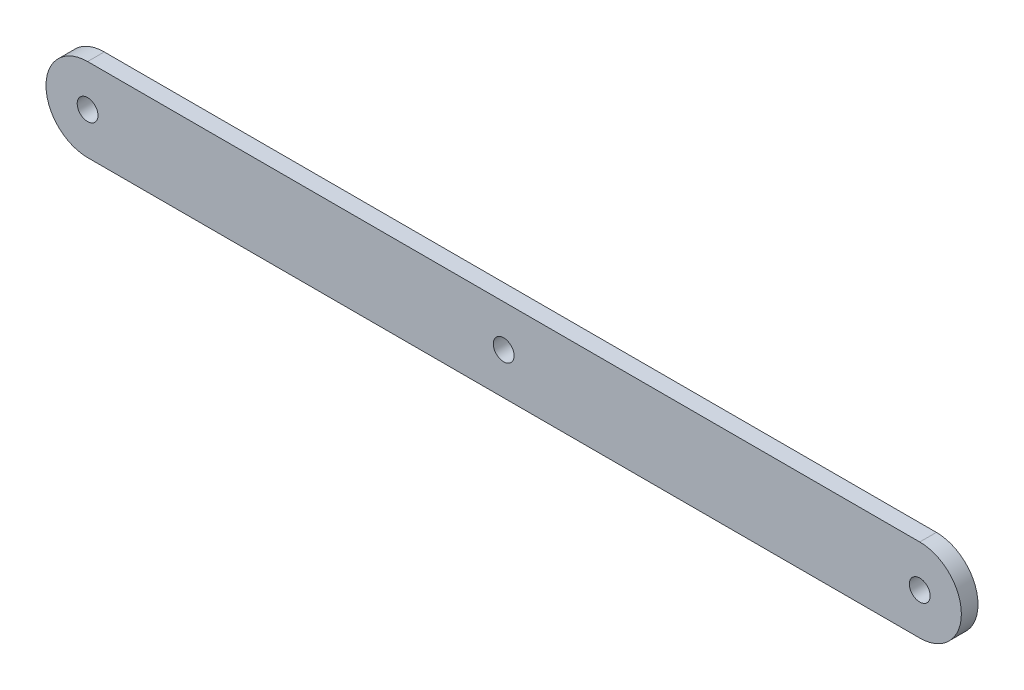
ISO-10303-21;
HEADER;
FILE_DESCRIPTION(('STEP AP214'),'2;1');
FILE_NAME('part.step','',(''),(''),'','','');
FILE_SCHEMA(('AUTOMOTIVE_DESIGN { 1 0 10303 214 1 1 1 1 }'));
ENDSEC;
DATA;
#1=APPLICATION_CONTEXT('core data for automotive mechanical design processes');
#2=APPLICATION_PROTOCOL_DEFINITION('international standard','automotive_design',2000,#1);
#3=PRODUCT_CONTEXT('',#1,'mechanical');
#4=PRODUCT('Part','Part','',(#3));
#5=PRODUCT_RELATED_PRODUCT_CATEGORY('part','',(#4));
#6=PRODUCT_DEFINITION_FORMATION('','',#4);
#7=PRODUCT_DEFINITION_CONTEXT('part definition',#1,'design');
#8=PRODUCT_DEFINITION('design','',#6,#7);
#9=PRODUCT_DEFINITION_SHAPE('','',#8);
#10=(LENGTH_UNIT() NAMED_UNIT(*) SI_UNIT(.MILLI.,.METRE.));
#11=(NAMED_UNIT(*) PLANE_ANGLE_UNIT() SI_UNIT($,.RADIAN.));
#12=(NAMED_UNIT(*) SI_UNIT($,.STERADIAN.) SOLID_ANGLE_UNIT());
#13=UNCERTAINTY_MEASURE_WITH_UNIT(LENGTH_MEASURE(1.E-05),#10,'distance_accuracy_value','');
#14=(GEOMETRIC_REPRESENTATION_CONTEXT(3) GLOBAL_UNCERTAINTY_ASSIGNED_CONTEXT((#13)) GLOBAL_UNIT_ASSIGNED_CONTEXT((#10,
#11,#12)) REPRESENTATION_CONTEXT('',''));
#15=CARTESIAN_POINT('',(0.,0.,0.));
#16=DIRECTION('',(0.,0.,1.));
#17=DIRECTION('',(1.,0.,0.));
#18=AXIS2_PLACEMENT_3D('',#15,#16,#17);
#19=CARTESIAN_POINT('',(-500.,0.,20.));
#20=DIRECTION('',(0.,0.,1.));
#21=DIRECTION('',(1.,0.,0.));
#22=AXIS2_PLACEMENT_3D('',#19,#20,#21);
#23=PLANE('',#22);
#24=CARTESIAN_POINT('',(500.,0.,20.));
#25=DIRECTION('',(0.,0.,1.));
#26=DIRECTION('',(1.,0.,0.));
#27=AXIS2_PLACEMENT_3D('',#24,#25,#26);
#28=CIRCLE('',#27,12.5);
#29=CARTESIAN_POINT('',(512.5,0.,20.));
#30=VERTEX_POINT('',#29);
#31=EDGE_CURVE('E116',#30,#30,#28,.T.);
#32=ORIENTED_EDGE('',*,*,#31,.F.);
#33=EDGE_LOOP('',(#32));
#34=FACE_BOUND('',#33,.T.);
#35=CARTESIAN_POINT('',(-500.,0.,20.));
#36=DIRECTION('',(0.,0.,1.));
#37=DIRECTION('',(1.,0.,0.));
#38=AXIS2_PLACEMENT_3D('',#35,#36,#37);
#39=CIRCLE('',#38,49.9999999999997);
#40=CARTESIAN_POINT('',(-500.,49.9999999999997,20.));
#41=VERTEX_POINT('',#40);
#42=CARTESIAN_POINT('',(-500.,-49.9999999999996,20.));
#43=VERTEX_POINT('',#42);
#44=EDGE_CURVE('E86',#41,#43,#39,.T.);
#45=ORIENTED_EDGE('',*,*,#44,.T.);
#46=DIRECTION('',(1.,0.,0.));
#47=VECTOR('',#46,1.);
#48=CARTESIAN_POINT('',(-500.,-49.9999999999996,20.));
#49=LINE('',#48,#47);
#50=CARTESIAN_POINT('',(500.,-50.,20.));
#51=VERTEX_POINT('',#50);
#52=EDGE_CURVE('E81',#43,#51,#49,.T.);
#53=ORIENTED_EDGE('',*,*,#52,.T.);
#54=CARTESIAN_POINT('',(500.,0.,20.));
#55=DIRECTION('',(0.,0.,1.));
#56=DIRECTION('',(1.,0.,0.));
#57=AXIS2_PLACEMENT_3D('',#54,#55,#56);
#58=CIRCLE('',#57,50.);
#59=CARTESIAN_POINT('',(500.,50.0000000000003,20.));
#60=VERTEX_POINT('',#59);
#61=EDGE_CURVE('E84',#51,#60,#58,.T.);
#62=ORIENTED_EDGE('',*,*,#61,.T.);
#63=DIRECTION('',(-1.,0.,0.));
#64=VECTOR('',#63,1.);
#65=CARTESIAN_POINT('',(-500.,49.9999999999997,20.));
#66=LINE('',#65,#64);
#67=EDGE_CURVE('E51',#60,#41,#66,.T.);
#68=ORIENTED_EDGE('',*,*,#67,.T.);
#69=EDGE_LOOP('',(#45,#53,#62,#68));
#70=FACE_BOUND('',#69,.T.);
#71=CARTESIAN_POINT('',(-500.,0.,20.));
#72=DIRECTION('',(0.,0.,1.));
#73=DIRECTION('',(1.,0.,0.));
#74=AXIS2_PLACEMENT_3D('',#71,#72,#73);
#75=CIRCLE('',#74,12.5);
#76=CARTESIAN_POINT('',(-487.5,0.,20.));
#77=VERTEX_POINT('',#76);
#78=EDGE_CURVE('E101',#77,#77,#75,.T.);
#79=ORIENTED_EDGE('',*,*,#78,.F.);
#80=EDGE_LOOP('',(#79));
#81=FACE_BOUND('',#80,.T.);
#82=CARTESIAN_POINT('',(0.,0.,20.));
#83=DIRECTION('',(0.,0.,1.));
#84=DIRECTION('',(1.,0.,0.));
#85=AXIS2_PLACEMENT_3D('',#82,#83,#84);
#86=CIRCLE('',#85,12.5);
#87=CARTESIAN_POINT('',(12.5,0.,20.));
#88=VERTEX_POINT('',#87);
#89=EDGE_CURVE('E122',#88,#88,#86,.T.);
#90=ORIENTED_EDGE('',*,*,#89,.F.);
#91=EDGE_LOOP('',(#90));
#92=FACE_BOUND('',#91,.T.);
#93=ADVANCED_FACE('F34',(#34,#70,#81,#92),#23,.T.);
#94=CARTESIAN_POINT('',(-500.,0.,0.));
#95=DIRECTION('',(0.,0.,1.));
#96=DIRECTION('',(1.,0.,0.));
#97=AXIS2_PLACEMENT_3D('',#94,#95,#96);
#98=PLANE('',#97);
#99=CARTESIAN_POINT('',(-500.,0.,0.));
#100=DIRECTION('',(0.,0.,1.));
#101=DIRECTION('',(1.,0.,0.));
#102=AXIS2_PLACEMENT_3D('',#99,#100,#101);
#103=CIRCLE('',#102,49.9999999999997);
#104=CARTESIAN_POINT('',(-500.,49.9999999999997,0.));
#105=VERTEX_POINT('',#104);
#106=CARTESIAN_POINT('',(-500.,-49.9999999999996,0.));
#107=VERTEX_POINT('',#106);
#108=EDGE_CURVE('E98',#105,#107,#103,.T.);
#109=ORIENTED_EDGE('',*,*,#108,.F.);
#110=DIRECTION('',(-1.,0.,0.));
#111=VECTOR('',#110,1.);
#112=CARTESIAN_POINT('',(-500.,49.9999999999997,0.));
#113=LINE('',#112,#111);
#114=CARTESIAN_POINT('',(500.,50.0000000000003,0.));
#115=VERTEX_POINT('',#114);
#116=EDGE_CURVE('E74',#115,#105,#113,.T.);
#117=ORIENTED_EDGE('',*,*,#116,.F.);
#118=CARTESIAN_POINT('',(500.,0.,0.));
#119=DIRECTION('',(0.,0.,1.));
#120=DIRECTION('',(1.,0.,0.));
#121=AXIS2_PLACEMENT_3D('',#118,#119,#120);
#122=CIRCLE('',#121,50.);
#123=CARTESIAN_POINT('',(500.,-50.,0.));
#124=VERTEX_POINT('',#123);
#125=EDGE_CURVE('E68',#124,#115,#122,.T.);
#126=ORIENTED_EDGE('',*,*,#125,.F.);
#127=DIRECTION('',(1.,0.,0.));
#128=VECTOR('',#127,1.);
#129=CARTESIAN_POINT('',(-500.,-49.9999999999996,0.));
#130=LINE('',#129,#128);
#131=EDGE_CURVE('E90',#107,#124,#130,.T.);
#132=ORIENTED_EDGE('',*,*,#131,.F.);
#133=EDGE_LOOP('',(#109,#117,#126,#132));
#134=FACE_BOUND('',#133,.T.);
#135=CARTESIAN_POINT('',(-500.,0.,0.));
#136=DIRECTION('',(0.,0.,1.));
#137=DIRECTION('',(1.,0.,0.));
#138=AXIS2_PLACEMENT_3D('',#135,#136,#137);
#139=CIRCLE('',#138,12.5);
#140=CARTESIAN_POINT('',(-487.5,0.,0.));
#141=VERTEX_POINT('',#140);
#142=EDGE_CURVE('E113',#141,#141,#139,.T.);
#143=ORIENTED_EDGE('',*,*,#142,.T.);
#144=EDGE_LOOP('',(#143));
#145=FACE_BOUND('',#144,.T.);
#146=CARTESIAN_POINT('',(500.,0.,0.));
#147=DIRECTION('',(0.,0.,1.));
#148=DIRECTION('',(1.,0.,0.));
#149=AXIS2_PLACEMENT_3D('',#146,#147,#148);
#150=CIRCLE('',#149,12.5);
#151=CARTESIAN_POINT('',(512.5,0.,0.));
#152=VERTEX_POINT('',#151);
#153=EDGE_CURVE('E119',#152,#152,#150,.T.);
#154=ORIENTED_EDGE('',*,*,#153,.T.);
#155=EDGE_LOOP('',(#154));
#156=FACE_BOUND('',#155,.T.);
#157=CARTESIAN_POINT('',(0.,0.,0.));
#158=DIRECTION('',(0.,0.,1.));
#159=DIRECTION('',(1.,0.,0.));
#160=AXIS2_PLACEMENT_3D('',#157,#158,#159);
#161=CIRCLE('',#160,12.5);
#162=CARTESIAN_POINT('',(12.5,0.,0.));
#163=VERTEX_POINT('',#162);
#164=EDGE_CURVE('E125',#163,#163,#161,.T.);
#165=ORIENTED_EDGE('',*,*,#164,.T.);
#166=EDGE_LOOP('',(#165));
#167=FACE_BOUND('',#166,.T.);
#168=ADVANCED_FACE('F109',(#134,#145,#156,#167),#98,.F.);
#169=CARTESIAN_POINT('',(-500.,0.,20.));
#170=DIRECTION('',(0.,0.,-1.));
#171=DIRECTION('',(-1.,0.,0.));
#172=AXIS2_PLACEMENT_3D('',#169,#170,#171);
#173=CYLINDRICAL_SURFACE('',#172,49.9999999999997);
#174=ORIENTED_EDGE('',*,*,#108,.T.);
#175=DIRECTION('',(0.,0.,-1.));
#176=VECTOR('',#175,1.);
#177=CARTESIAN_POINT('',(-500.,-49.9999999999996,20.));
#178=LINE('',#177,#176);
#179=EDGE_CURVE('E11',#43,#107,#178,.T.);
#180=ORIENTED_EDGE('',*,*,#179,.F.);
#181=ORIENTED_EDGE('',*,*,#44,.F.);
#182=DIRECTION('',(0.,0.,-1.));
#183=VECTOR('',#182,1.);
#184=CARTESIAN_POINT('',(-500.,49.9999999999997,20.));
#185=LINE('',#184,#183);
#186=EDGE_CURVE('E94',#41,#105,#185,.T.);
#187=ORIENTED_EDGE('',*,*,#186,.T.);
#188=EDGE_LOOP('',(#174,#180,#181,#187));
#189=FACE_BOUND('',#188,.T.);
#190=ADVANCED_FACE('F36',(#189),#173,.T.);
#191=CARTESIAN_POINT('',(-500.,-49.9999999999996,20.));
#192=DIRECTION('',(0.,1.,0.));
#193=DIRECTION('',(-1.,0.,0.));
#194=AXIS2_PLACEMENT_3D('',#191,#192,#193);
#195=PLANE('',#194);
#196=ORIENTED_EDGE('',*,*,#131,.T.);
#197=DIRECTION('',(0.,0.,-1.));
#198=VECTOR('',#197,1.);
#199=CARTESIAN_POINT('',(500.,-50.,20.));
#200=LINE('',#199,#198);
#201=EDGE_CURVE('E43',#51,#124,#200,.T.);
#202=ORIENTED_EDGE('',*,*,#201,.F.);
#203=ORIENTED_EDGE('',*,*,#52,.F.);
#204=ORIENTED_EDGE('',*,*,#179,.T.);
#205=EDGE_LOOP('',(#196,#202,#203,#204));
#206=FACE_BOUND('',#205,.T.);
#207=ADVANCED_FACE('F89',(#206),#195,.F.);
#208=CARTESIAN_POINT('',(500.,0.,20.));
#209=DIRECTION('',(0.,0.,-1.));
#210=DIRECTION('',(-1.,0.,0.));
#211=AXIS2_PLACEMENT_3D('',#208,#209,#210);
#212=CYLINDRICAL_SURFACE('',#211,50.);
#213=ORIENTED_EDGE('',*,*,#125,.T.);
#214=DIRECTION('',(0.,0.,-1.));
#215=VECTOR('',#214,1.);
#216=CARTESIAN_POINT('',(500.,50.0000000000003,20.));
#217=LINE('',#216,#215);
#218=EDGE_CURVE('E91',#60,#115,#217,.T.);
#219=ORIENTED_EDGE('',*,*,#218,.F.);
#220=ORIENTED_EDGE('',*,*,#61,.F.);
#221=ORIENTED_EDGE('',*,*,#201,.T.);
#222=EDGE_LOOP('',(#213,#219,#220,#221));
#223=FACE_BOUND('',#222,.T.);
#224=ADVANCED_FACE('F92',(#223),#212,.T.);
#225=CARTESIAN_POINT('',(-500.,49.9999999999997,20.));
#226=DIRECTION('',(0.,-1.,0.));
#227=DIRECTION('',(1.,0.,0.));
#228=AXIS2_PLACEMENT_3D('',#225,#226,#227);
#229=PLANE('',#228);
#230=ORIENTED_EDGE('',*,*,#116,.T.);
#231=ORIENTED_EDGE('',*,*,#186,.F.);
#232=ORIENTED_EDGE('',*,*,#67,.F.);
#233=ORIENTED_EDGE('',*,*,#218,.T.);
#234=EDGE_LOOP('',(#230,#231,#232,#233));
#235=FACE_BOUND('',#234,.T.);
#236=ADVANCED_FACE('F106',(#235),#229,.F.);
#237=CARTESIAN_POINT('',(-500.,0.,20.));
#238=DIRECTION('',(0.,0.,-1.));
#239=DIRECTION('',(-1.,0.,0.));
#240=AXIS2_PLACEMENT_3D('',#237,#238,#239);
#241=CYLINDRICAL_SURFACE('',#240,12.5);
#242=ORIENTED_EDGE('',*,*,#78,.T.);
#243=EDGE_LOOP('',(#242));
#244=FACE_BOUND('',#243,.T.);
#245=ORIENTED_EDGE('',*,*,#142,.F.);
#246=EDGE_LOOP('',(#245));
#247=FACE_BOUND('',#246,.T.);
#248=ADVANCED_FACE('F143',(#244,#247),#241,.F.);
#249=CARTESIAN_POINT('',(500.,0.,20.));
#250=DIRECTION('',(0.,0.,-1.));
#251=DIRECTION('',(-1.,0.,0.));
#252=AXIS2_PLACEMENT_3D('',#249,#250,#251);
#253=CYLINDRICAL_SURFACE('',#252,12.5);
#254=ORIENTED_EDGE('',*,*,#31,.T.);
#255=EDGE_LOOP('',(#254));
#256=FACE_BOUND('',#255,.T.);
#257=ORIENTED_EDGE('',*,*,#153,.F.);
#258=EDGE_LOOP('',(#257));
#259=FACE_BOUND('',#258,.T.);
#260=ADVANCED_FACE('F189',(#256,#259),#253,.F.);
#261=CARTESIAN_POINT('',(0.,0.,20.));
#262=DIRECTION('',(0.,0.,-1.));
#263=DIRECTION('',(-1.,0.,0.));
#264=AXIS2_PLACEMENT_3D('',#261,#262,#263);
#265=CYLINDRICAL_SURFACE('',#264,12.5);
#266=ORIENTED_EDGE('',*,*,#89,.T.);
#267=EDGE_LOOP('',(#266));
#268=FACE_BOUND('',#267,.T.);
#269=ORIENTED_EDGE('',*,*,#164,.F.);
#270=EDGE_LOOP('',(#269));
#271=FACE_BOUND('',#270,.T.);
#272=ADVANCED_FACE('F131',(#268,#271),#265,.F.);
#273=CLOSED_SHELL('',(#93,#168,#190,#207,#224,#236,#248,#260,#272));
#274=MANIFOLD_SOLID_BREP('B2',#273);
#275=ADVANCED_BREP_SHAPE_REPRESENTATION('',(#18,#274),#14);
#276=SHAPE_DEFINITION_REPRESENTATION(#9,#275);
ENDSEC;
END-ISO-10303-21;
